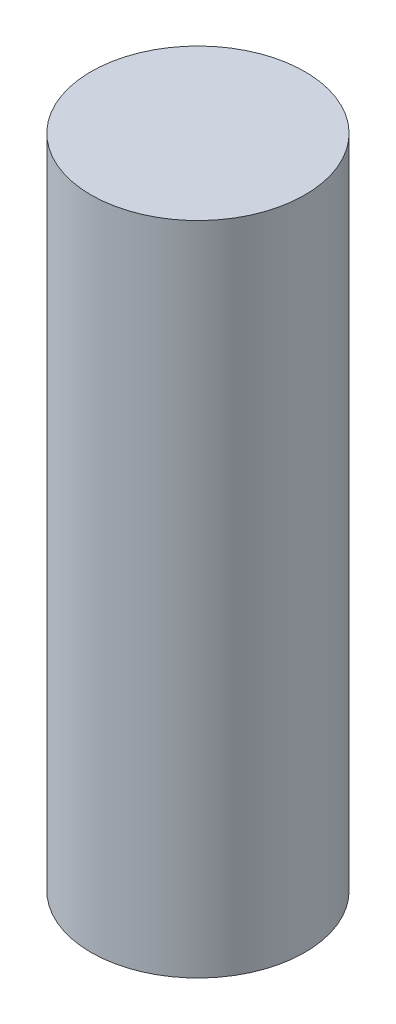
ISO-10303-21;
HEADER;
FILE_DESCRIPTION(('STEP AP214'),'2;1');
FILE_NAME('part.step','',(''),(''),'','','');
FILE_SCHEMA(('AUTOMOTIVE_DESIGN { 1 0 10303 214 1 1 1 1 }'));
ENDSEC;
DATA;
#1=APPLICATION_CONTEXT('core data for automotive mechanical design processes');
#2=APPLICATION_PROTOCOL_DEFINITION('international standard','automotive_design',2000,#1);
#3=PRODUCT_CONTEXT('',#1,'mechanical');
#4=PRODUCT('Part','Part','',(#3));
#5=PRODUCT_RELATED_PRODUCT_CATEGORY('part','',(#4));
#6=PRODUCT_DEFINITION_FORMATION('','',#4);
#7=PRODUCT_DEFINITION_CONTEXT('part definition',#1,'design');
#8=PRODUCT_DEFINITION('design','',#6,#7);
#9=PRODUCT_DEFINITION_SHAPE('','',#8);
#10=(LENGTH_UNIT() NAMED_UNIT(*) SI_UNIT(.MILLI.,.METRE.));
#11=(NAMED_UNIT(*) PLANE_ANGLE_UNIT() SI_UNIT($,.RADIAN.));
#12=(NAMED_UNIT(*) SI_UNIT($,.STERADIAN.) SOLID_ANGLE_UNIT());
#13=UNCERTAINTY_MEASURE_WITH_UNIT(LENGTH_MEASURE(1.E-05),#10,'distance_accuracy_value','');
#14=(GEOMETRIC_REPRESENTATION_CONTEXT(3) GLOBAL_UNCERTAINTY_ASSIGNED_CONTEXT((#13)) GLOBAL_UNIT_ASSIGNED_CONTEXT((#10,
#11,#12)) REPRESENTATION_CONTEXT('',''));
#15=CARTESIAN_POINT('',(0.,0.,0.));
#16=DIRECTION('',(0.,0.,1.));
#17=DIRECTION('',(1.,0.,0.));
#18=AXIS2_PLACEMENT_3D('',#15,#16,#17);
#19=CARTESIAN_POINT('',(0.,13.5,0.));
#20=DIRECTION('',(0.,-1.,0.));
#21=DIRECTION('',(0.,0.,-1.));
#22=AXIS2_PLACEMENT_3D('',#19,#20,#21);
#23=CYLINDRICAL_SURFACE('',#22,2.2);
#24=CARTESIAN_POINT('',(0.,13.5,0.));
#25=DIRECTION('',(0.,1.,0.));
#26=DIRECTION('',(0.,0.,1.));
#27=AXIS2_PLACEMENT_3D('',#24,#25,#26);
#28=CIRCLE('',#27,2.2);
#29=CARTESIAN_POINT('',(0.,13.5,2.2));
#30=VERTEX_POINT('',#29);
#31=EDGE_CURVE('E10',#30,#30,#28,.T.);
#32=ORIENTED_EDGE('',*,*,#31,.F.);
#33=EDGE_LOOP('',(#32));
#34=FACE_BOUND('',#33,.T.);
#35=CARTESIAN_POINT('',(0.,0.,0.));
#36=DIRECTION('',(0.,1.,0.));
#37=DIRECTION('',(0.,0.,1.));
#38=AXIS2_PLACEMENT_3D('',#35,#36,#37);
#39=CIRCLE('',#38,2.2);
#40=CARTESIAN_POINT('',(0.,0.,2.2));
#41=VERTEX_POINT('',#40);
#42=EDGE_CURVE('E46',#41,#41,#39,.T.);
#43=ORIENTED_EDGE('',*,*,#42,.T.);
#44=EDGE_LOOP('',(#43));
#45=FACE_BOUND('',#44,.T.);
#46=ADVANCED_FACE('F43',(#34,#45),#23,.T.);
#47=CARTESIAN_POINT('',(0.,13.5,0.));
#48=DIRECTION('',(0.,1.,0.));
#49=DIRECTION('',(0.,0.,1.));
#50=AXIS2_PLACEMENT_3D('',#47,#48,#49);
#51=PLANE('',#50);
#52=ORIENTED_EDGE('',*,*,#31,.T.);
#53=EDGE_LOOP('',(#52));
#54=FACE_BOUND('',#53,.T.);
#55=ADVANCED_FACE('F60',(#54),#51,.T.);
#56=CARTESIAN_POINT('',(0.,0.,0.));
#57=DIRECTION('',(0.,1.,0.));
#58=DIRECTION('',(0.,0.,1.));
#59=AXIS2_PLACEMENT_3D('',#56,#57,#58);
#60=PLANE('',#59);
#61=ORIENTED_EDGE('',*,*,#42,.F.);
#62=EDGE_LOOP('',(#61));
#63=FACE_BOUND('',#62,.T.);
#64=ADVANCED_FACE('F58',(#63),#60,.F.);
#65=CLOSED_SHELL('',(#46,#55,#64));
#66=MANIFOLD_SOLID_BREP('B2',#65);
#67=ADVANCED_BREP_SHAPE_REPRESENTATION('',(#18,#66),#14);
#68=SHAPE_DEFINITION_REPRESENTATION(#9,#67);
ENDSEC;
END-ISO-10303-21;
